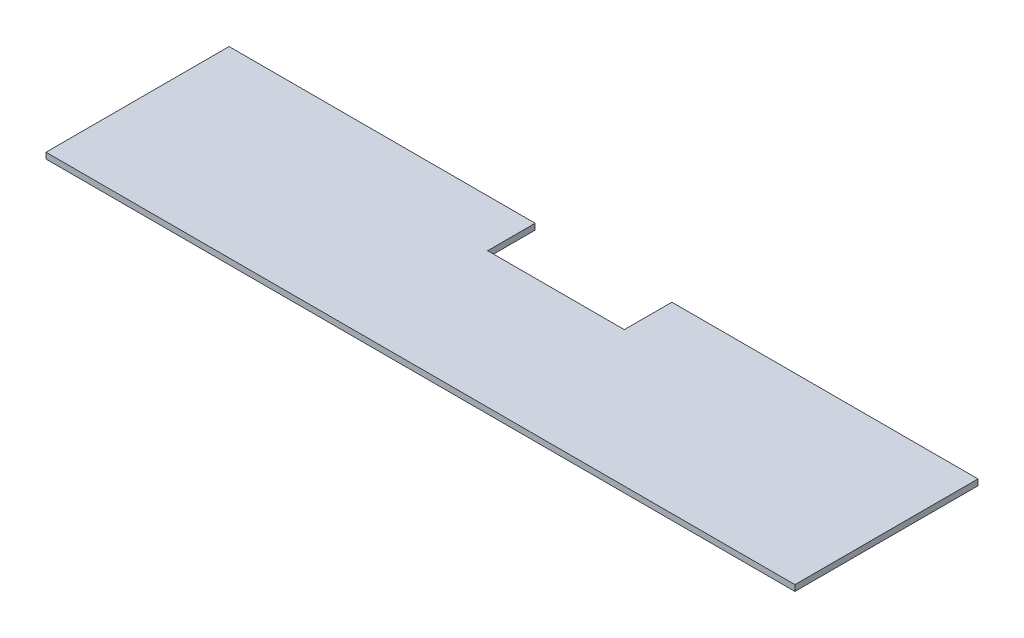
ISO-10303-21;
HEADER;
FILE_DESCRIPTION(('STEP AP214'),'2;1');
FILE_NAME('part.step','',(''),(''),'','','');
FILE_SCHEMA(('AUTOMOTIVE_DESIGN { 1 0 10303 214 1 1 1 1 }'));
ENDSEC;
DATA;
#1=APPLICATION_CONTEXT('core data for automotive mechanical design processes');
#2=APPLICATION_PROTOCOL_DEFINITION('international standard','automotive_design',2000,#1);
#3=PRODUCT_CONTEXT('',#1,'mechanical');
#4=PRODUCT('Part','Part','',(#3));
#5=PRODUCT_RELATED_PRODUCT_CATEGORY('part','',(#4));
#6=PRODUCT_DEFINITION_FORMATION('','',#4);
#7=PRODUCT_DEFINITION_CONTEXT('part definition',#1,'design');
#8=PRODUCT_DEFINITION('design','',#6,#7);
#9=PRODUCT_DEFINITION_SHAPE('','',#8);
#10=(LENGTH_UNIT() NAMED_UNIT(*) SI_UNIT(.MILLI.,.METRE.));
#11=(NAMED_UNIT(*) PLANE_ANGLE_UNIT() SI_UNIT($,.RADIAN.));
#12=(NAMED_UNIT(*) SI_UNIT($,.STERADIAN.) SOLID_ANGLE_UNIT());
#13=UNCERTAINTY_MEASURE_WITH_UNIT(LENGTH_MEASURE(1.E-05),#10,'distance_accuracy_value','');
#14=(GEOMETRIC_REPRESENTATION_CONTEXT(3) GLOBAL_UNCERTAINTY_ASSIGNED_CONTEXT((#13)) GLOBAL_UNIT_ASSIGNED_CONTEXT((#10,
#11,#12)) REPRESENTATION_CONTEXT('',''));
#15=CARTESIAN_POINT('',(0.,0.,0.));
#16=DIRECTION('',(0.,0.,1.));
#17=DIRECTION('',(1.,0.,0.));
#18=AXIS2_PLACEMENT_3D('',#15,#16,#17);
#19=CARTESIAN_POINT('',(0.,6.35,-195.58));
#20=DIRECTION('',(0.,0.,1.));
#21=DIRECTION('',(1.,0.,0.));
#22=AXIS2_PLACEMENT_3D('',#19,#20,#21);
#23=PLANE('',#22);
#24=DIRECTION('',(-1.,0.,0.));
#25=VECTOR('',#24,1.);
#26=CARTESIAN_POINT('',(0.,6.35,-195.58));
#27=LINE('',#26,#25);
#28=CARTESIAN_POINT('',(117.475,6.35,-195.58));
#29=VERTEX_POINT('',#28);
#30=CARTESIAN_POINT('',(-209.55,6.35,-195.58));
#31=VERTEX_POINT('',#30);
#32=EDGE_CURVE('E44',#29,#31,#27,.T.);
#33=ORIENTED_EDGE('',*,*,#32,.F.);
#34=DIRECTION('',(0.,1.,0.));
#35=VECTOR('',#34,1.);
#36=CARTESIAN_POINT('',(117.475,0.,-195.58));
#37=LINE('',#36,#35);
#38=CARTESIAN_POINT('',(117.475,0.,-195.58));
#39=VERTEX_POINT('',#38);
#40=EDGE_CURVE('E113',#39,#29,#37,.T.);
#41=ORIENTED_EDGE('',*,*,#40,.F.);
#42=DIRECTION('',(-1.,0.,0.));
#43=VECTOR('',#42,1.);
#44=CARTESIAN_POINT('',(0.,0.,-195.58));
#45=LINE('',#44,#43);
#46=CARTESIAN_POINT('',(-209.55,0.,-195.58));
#47=VERTEX_POINT('',#46);
#48=EDGE_CURVE('E81',#39,#47,#45,.T.);
#49=ORIENTED_EDGE('',*,*,#48,.T.);
#50=DIRECTION('',(0.,-1.,0.));
#51=VECTOR('',#50,1.);
#52=CARTESIAN_POINT('',(-209.55,6.35,-195.58));
#53=LINE('',#52,#51);
#54=EDGE_CURVE('E91',#31,#47,#53,.T.);
#55=ORIENTED_EDGE('',*,*,#54,.F.);
#56=EDGE_LOOP('',(#33,#41,#49,#55));
#57=FACE_BOUND('',#56,.T.);
#58=ADVANCED_FACE('F35',(#57),#23,.F.);
#59=CARTESIAN_POINT('',(0.,6.35,0.));
#60=DIRECTION('',(0.,0.,-1.));
#61=DIRECTION('',(-1.,0.,0.));
#62=AXIS2_PLACEMENT_3D('',#59,#60,#61);
#63=PLANE('',#62);
#64=DIRECTION('',(1.,0.,0.));
#65=VECTOR('',#64,1.);
#66=CARTESIAN_POINT('',(0.,0.,0.));
#67=LINE('',#66,#65);
#68=CARTESIAN_POINT('',(-209.55,0.,0.));
#69=VERTEX_POINT('',#68);
#70=CARTESIAN_POINT('',(590.55,0.,0.));
#71=VERTEX_POINT('',#70);
#72=EDGE_CURVE('E95',#69,#71,#67,.T.);
#73=ORIENTED_EDGE('',*,*,#72,.T.);
#74=DIRECTION('',(0.,-1.,0.));
#75=VECTOR('',#74,1.);
#76=CARTESIAN_POINT('',(590.55,6.35,0.));
#77=LINE('',#76,#75);
#78=CARTESIAN_POINT('',(590.55,6.35,0.));
#79=VERTEX_POINT('',#78);
#80=EDGE_CURVE('E89',#79,#71,#77,.T.);
#81=ORIENTED_EDGE('',*,*,#80,.F.);
#82=DIRECTION('',(1.,0.,0.));
#83=VECTOR('',#82,1.);
#84=CARTESIAN_POINT('',(0.,6.35,0.));
#85=LINE('',#84,#83);
#86=CARTESIAN_POINT('',(-209.55,6.35,0.));
#87=VERTEX_POINT('',#86);
#88=EDGE_CURVE('E80',#87,#79,#85,.T.);
#89=ORIENTED_EDGE('',*,*,#88,.F.);
#90=DIRECTION('',(0.,-1.,0.));
#91=VECTOR('',#90,1.);
#92=CARTESIAN_POINT('',(-209.55,6.35,0.));
#93=LINE('',#92,#91);
#94=EDGE_CURVE('E124',#87,#69,#93,.T.);
#95=ORIENTED_EDGE('',*,*,#94,.T.);
#96=EDGE_LOOP('',(#73,#81,#89,#95));
#97=FACE_BOUND('',#96,.T.);
#98=ADVANCED_FACE('F37',(#97),#63,.F.);
#99=CARTESIAN_POINT('',(590.55,0.,-195.58));
#100=VERTEX_POINT('',#99);
#101=CARTESIAN_POINT('',(263.525,0.,-195.58));
#102=VERTEX_POINT('',#101);
#103=EDGE_CURVE('E39',#100,#102,#45,.T.);
#104=ORIENTED_EDGE('',*,*,#103,.T.);
#105=DIRECTION('',(0.,1.,0.));
#106=VECTOR('',#105,1.);
#107=CARTESIAN_POINT('',(263.525,0.,-195.58));
#108=LINE('',#107,#106);
#109=CARTESIAN_POINT('',(263.525,6.35,-195.58));
#110=VERTEX_POINT('',#109);
#111=EDGE_CURVE('E128',#102,#110,#108,.T.);
#112=ORIENTED_EDGE('',*,*,#111,.T.);
#113=CARTESIAN_POINT('',(590.55,6.35,-195.58));
#114=VERTEX_POINT('',#113);
#115=EDGE_CURVE('E11',#114,#110,#27,.T.);
#116=ORIENTED_EDGE('',*,*,#115,.F.);
#117=DIRECTION('',(0.,-1.,0.));
#118=VECTOR('',#117,1.);
#119=CARTESIAN_POINT('',(590.55,6.35,-195.58));
#120=LINE('',#119,#118);
#121=EDGE_CURVE('E87',#114,#100,#120,.T.);
#122=ORIENTED_EDGE('',*,*,#121,.T.);
#123=EDGE_LOOP('',(#104,#112,#116,#122));
#124=FACE_BOUND('',#123,.T.);
#125=ADVANCED_FACE('F93',(#124),#23,.F.);
#126=CARTESIAN_POINT('',(0.,6.35,0.));
#127=DIRECTION('',(0.,-1.,0.));
#128=DIRECTION('',(0.,0.,-1.));
#129=AXIS2_PLACEMENT_3D('',#126,#127,#128);
#130=PLANE('',#129);
#131=DIRECTION('',(1.,0.,0.));
#132=VECTOR('',#131,1.);
#133=CARTESIAN_POINT('',(117.475,6.35,-144.78));
#134=LINE('',#133,#132);
#135=CARTESIAN_POINT('',(117.475,6.35,-144.78));
#136=VERTEX_POINT('',#135);
#137=CARTESIAN_POINT('',(263.525,6.35,-144.78));
#138=VERTEX_POINT('',#137);
#139=EDGE_CURVE('E169',#136,#138,#134,.T.);
#140=ORIENTED_EDGE('',*,*,#139,.F.);
#141=DIRECTION('',(0.,0.,1.));
#142=VECTOR('',#141,1.);
#143=CARTESIAN_POINT('',(117.475,6.35,-195.58));
#144=LINE('',#143,#142);
#145=EDGE_CURVE('E159',#29,#136,#144,.T.);
#146=ORIENTED_EDGE('',*,*,#145,.F.);
#147=ORIENTED_EDGE('',*,*,#32,.T.);
#148=DIRECTION('',(0.,0.,1.));
#149=VECTOR('',#148,1.);
#150=CARTESIAN_POINT('',(-209.55,6.35,0.));
#151=LINE('',#150,#149);
#152=EDGE_CURVE('E123',#31,#87,#151,.T.);
#153=ORIENTED_EDGE('',*,*,#152,.T.);
#154=ORIENTED_EDGE('',*,*,#88,.T.);
#155=DIRECTION('',(0.,0.,-1.));
#156=VECTOR('',#155,1.);
#157=CARTESIAN_POINT('',(590.55,6.35,0.));
#158=LINE('',#157,#156);
#159=EDGE_CURVE('E90',#79,#114,#158,.T.);
#160=ORIENTED_EDGE('',*,*,#159,.T.);
#161=ORIENTED_EDGE('',*,*,#115,.T.);
#162=DIRECTION('',(0.,0.,-1.));
#163=VECTOR('',#162,1.);
#164=CARTESIAN_POINT('',(263.525,6.35,-195.58));
#165=LINE('',#164,#163);
#166=EDGE_CURVE('E167',#138,#110,#165,.T.);
#167=ORIENTED_EDGE('',*,*,#166,.F.);
#168=EDGE_LOOP('',(#140,#146,#147,#153,#154,#160,#161,#167));
#169=FACE_BOUND('',#168,.T.);
#170=ADVANCED_FACE('F179',(#169),#130,.F.);
#171=CARTESIAN_POINT('',(0.,0.,0.));
#172=DIRECTION('',(0.,-1.,0.));
#173=DIRECTION('',(0.,0.,-1.));
#174=AXIS2_PLACEMENT_3D('',#171,#172,#173);
#175=PLANE('',#174);
#176=DIRECTION('',(0.,0.,1.));
#177=VECTOR('',#176,1.);
#178=CARTESIAN_POINT('',(117.475,0.,-195.58));
#179=LINE('',#178,#177);
#180=CARTESIAN_POINT('',(117.475,0.,-144.78));
#181=VERTEX_POINT('',#180);
#182=EDGE_CURVE('E157',#39,#181,#179,.T.);
#183=ORIENTED_EDGE('',*,*,#182,.T.);
#184=DIRECTION('',(1.,0.,0.));
#185=VECTOR('',#184,1.);
#186=CARTESIAN_POINT('',(117.475,0.,-144.78));
#187=LINE('',#186,#185);
#188=CARTESIAN_POINT('',(263.525,0.,-144.78));
#189=VERTEX_POINT('',#188);
#190=EDGE_CURVE('E164',#181,#189,#187,.T.);
#191=ORIENTED_EDGE('',*,*,#190,.T.);
#192=DIRECTION('',(0.,0.,-1.));
#193=VECTOR('',#192,1.);
#194=CARTESIAN_POINT('',(263.525,0.,-195.58));
#195=LINE('',#194,#193);
#196=EDGE_CURVE('E52',#189,#102,#195,.T.);
#197=ORIENTED_EDGE('',*,*,#196,.T.);
#198=ORIENTED_EDGE('',*,*,#103,.F.);
#199=DIRECTION('',(0.,0.,-1.));
#200=VECTOR('',#199,1.);
#201=CARTESIAN_POINT('',(590.55,0.,0.));
#202=LINE('',#201,#200);
#203=EDGE_CURVE('E77',#71,#100,#202,.T.);
#204=ORIENTED_EDGE('',*,*,#203,.F.);
#205=ORIENTED_EDGE('',*,*,#72,.F.);
#206=DIRECTION('',(0.,0.,1.));
#207=VECTOR('',#206,1.);
#208=CARTESIAN_POINT('',(-209.55,0.,0.));
#209=LINE('',#208,#207);
#210=EDGE_CURVE('E121',#47,#69,#209,.T.);
#211=ORIENTED_EDGE('',*,*,#210,.F.);
#212=ORIENTED_EDGE('',*,*,#48,.F.);
#213=EDGE_LOOP('',(#183,#191,#197,#198,#204,#205,#211,#212));
#214=FACE_BOUND('',#213,.T.);
#215=ADVANCED_FACE('F75',(#214),#175,.T.);
#216=CARTESIAN_POINT('',(590.55,6.35,0.));
#217=DIRECTION('',(-1.,0.,0.));
#218=DIRECTION('',(0.,0.,1.));
#219=AXIS2_PLACEMENT_3D('',#216,#217,#218);
#220=PLANE('',#219);
#221=ORIENTED_EDGE('',*,*,#203,.T.);
#222=ORIENTED_EDGE('',*,*,#121,.F.);
#223=ORIENTED_EDGE('',*,*,#159,.F.);
#224=ORIENTED_EDGE('',*,*,#80,.T.);
#225=EDGE_LOOP('',(#221,#222,#223,#224));
#226=FACE_BOUND('',#225,.T.);
#227=ADVANCED_FACE('F85',(#226),#220,.F.);
#228=CARTESIAN_POINT('',(-209.55,6.35,0.));
#229=DIRECTION('',(1.,0.,0.));
#230=DIRECTION('',(0.,0.,-1.));
#231=AXIS2_PLACEMENT_3D('',#228,#229,#230);
#232=PLANE('',#231);
#233=ORIENTED_EDGE('',*,*,#210,.T.);
#234=ORIENTED_EDGE('',*,*,#94,.F.);
#235=ORIENTED_EDGE('',*,*,#152,.F.);
#236=ORIENTED_EDGE('',*,*,#54,.T.);
#237=EDGE_LOOP('',(#233,#234,#235,#236));
#238=FACE_BOUND('',#237,.T.);
#239=ADVANCED_FACE('F119',(#238),#232,.F.);
#240=CARTESIAN_POINT('',(117.475,0.,-195.58));
#241=DIRECTION('',(-1.,0.,0.));
#242=DIRECTION('',(0.,0.,1.));
#243=AXIS2_PLACEMENT_3D('',#240,#241,#242);
#244=PLANE('',#243);
#245=ORIENTED_EDGE('',*,*,#145,.T.);
#246=DIRECTION('',(0.,1.,0.));
#247=VECTOR('',#246,1.);
#248=CARTESIAN_POINT('',(117.475,0.,-144.78));
#249=LINE('',#248,#247);
#250=EDGE_CURVE('E154',#181,#136,#249,.T.);
#251=ORIENTED_EDGE('',*,*,#250,.F.);
#252=ORIENTED_EDGE('',*,*,#182,.F.);
#253=ORIENTED_EDGE('',*,*,#40,.T.);
#254=EDGE_LOOP('',(#245,#251,#252,#253));
#255=FACE_BOUND('',#254,.T.);
#256=ADVANCED_FACE('F156',(#255),#244,.F.);
#257=CARTESIAN_POINT('',(263.525,0.,-195.58));
#258=DIRECTION('',(1.,0.,0.));
#259=DIRECTION('',(0.,0.,-1.));
#260=AXIS2_PLACEMENT_3D('',#257,#258,#259);
#261=PLANE('',#260);
#262=ORIENTED_EDGE('',*,*,#166,.T.);
#263=ORIENTED_EDGE('',*,*,#111,.F.);
#264=ORIENTED_EDGE('',*,*,#196,.F.);
#265=DIRECTION('',(0.,1.,0.));
#266=VECTOR('',#265,1.);
#267=CARTESIAN_POINT('',(263.525,0.,-144.78));
#268=LINE('',#267,#266);
#269=EDGE_CURVE('E163',#189,#138,#268,.T.);
#270=ORIENTED_EDGE('',*,*,#269,.T.);
#271=EDGE_LOOP('',(#262,#263,#264,#270));
#272=FACE_BOUND('',#271,.T.);
#273=ADVANCED_FACE('F176',(#272),#261,.F.);
#274=CARTESIAN_POINT('',(117.475,0.,-144.78));
#275=DIRECTION('',(0.,0.,1.));
#276=DIRECTION('',(1.,0.,0.));
#277=AXIS2_PLACEMENT_3D('',#274,#275,#276);
#278=PLANE('',#277);
#279=ORIENTED_EDGE('',*,*,#139,.T.);
#280=ORIENTED_EDGE('',*,*,#269,.F.);
#281=ORIENTED_EDGE('',*,*,#190,.F.);
#282=ORIENTED_EDGE('',*,*,#250,.T.);
#283=EDGE_LOOP('',(#279,#280,#281,#282));
#284=FACE_BOUND('',#283,.T.);
#285=ADVANCED_FACE('F165',(#284),#278,.F.);
#286=CLOSED_SHELL('',(#58,#98,#125,#170,#215,#227,#239,#256,#273,#285));
#287=MANIFOLD_SOLID_BREP('B2',#286);
#288=ADVANCED_BREP_SHAPE_REPRESENTATION('',(#18,#287),#14);
#289=SHAPE_DEFINITION_REPRESENTATION(#9,#288);
ENDSEC;
END-ISO-10303-21;
